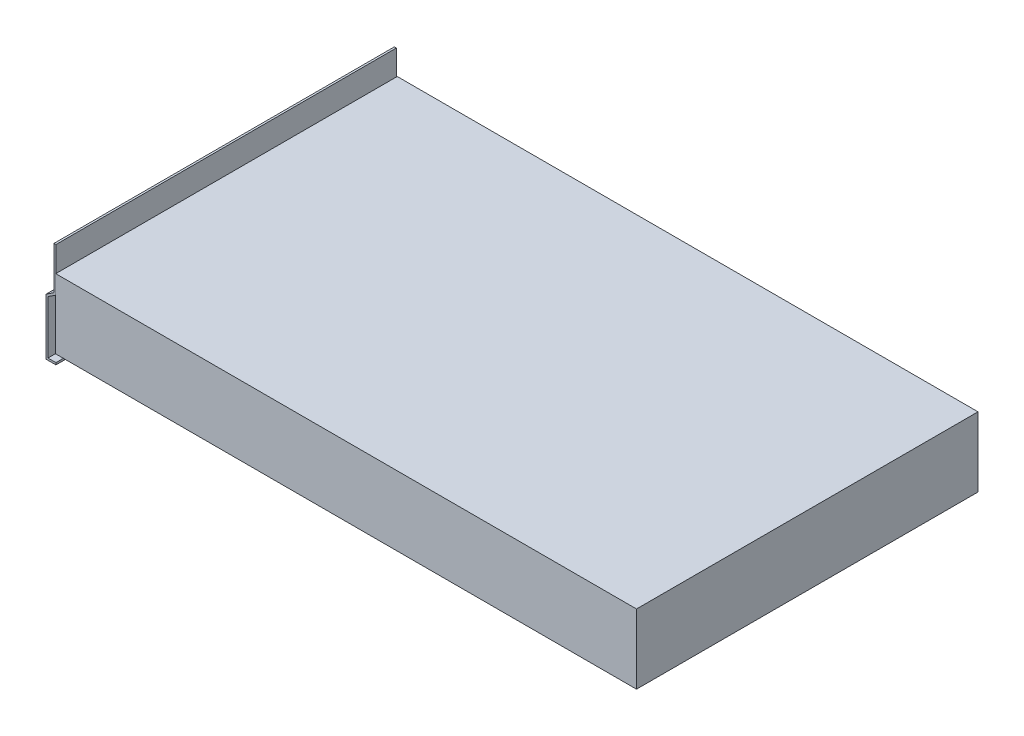
ISO-10303-21;
HEADER;
FILE_DESCRIPTION(('STEP AP214'),'2;1');
FILE_NAME('part.step','',(''),(''),'','','');
FILE_SCHEMA(('AUTOMOTIVE_DESIGN { 1 0 10303 214 1 1 1 1 }'));
ENDSEC;
DATA;
#1=APPLICATION_CONTEXT('core data for automotive mechanical design processes');
#2=APPLICATION_PROTOCOL_DEFINITION('international standard','automotive_design',2000,#1);
#3=PRODUCT_CONTEXT('',#1,'mechanical');
#4=PRODUCT('Part','Part','',(#3));
#5=PRODUCT_RELATED_PRODUCT_CATEGORY('part','',(#4));
#6=PRODUCT_DEFINITION_FORMATION('','',#4);
#7=PRODUCT_DEFINITION_CONTEXT('part definition',#1,'design');
#8=PRODUCT_DEFINITION('design','',#6,#7);
#9=PRODUCT_DEFINITION_SHAPE('','',#8);
#10=(LENGTH_UNIT() NAMED_UNIT(*) SI_UNIT(.MILLI.,.METRE.));
#11=(NAMED_UNIT(*) PLANE_ANGLE_UNIT() SI_UNIT($,.RADIAN.));
#12=(NAMED_UNIT(*) SI_UNIT($,.STERADIAN.) SOLID_ANGLE_UNIT());
#13=UNCERTAINTY_MEASURE_WITH_UNIT(LENGTH_MEASURE(1.E-05),#10,'distance_accuracy_value','');
#14=(GEOMETRIC_REPRESENTATION_CONTEXT(3) GLOBAL_UNCERTAINTY_ASSIGNED_CONTEXT((#13)) GLOBAL_UNIT_ASSIGNED_CONTEXT((#10,
#11,#12)) REPRESENTATION_CONTEXT('',''));
#15=CARTESIAN_POINT('',(0.,0.,0.));
#16=DIRECTION('',(0.,0.,1.));
#17=DIRECTION('',(1.,0.,0.));
#18=AXIS2_PLACEMENT_3D('',#15,#16,#17);
#19=CARTESIAN_POINT('',(0.,52.,171.5));
#20=DIRECTION('',(-1.,0.,0.));
#21=DIRECTION('',(0.,0.,1.));
#22=AXIS2_PLACEMENT_3D('',#19,#20,#21);
#23=PLANE('',#22);
#24=DIRECTION('',(0.,1.,0.));
#25=VECTOR('',#24,1.);
#26=CARTESIAN_POINT('',(0.,52.,-171.5));
#27=LINE('',#26,#25);
#28=CARTESIAN_POINT('',(0.,50.9283560127222,-171.5));
#29=VERTEX_POINT('',#28);
#30=CARTESIAN_POINT('',(0.,95.,-171.5));
#31=VERTEX_POINT('',#30);
#32=EDGE_CURVE('E151',#29,#31,#27,.T.);
#33=ORIENTED_EDGE('',*,*,#32,.T.);
#34=DIRECTION('',(0.,0.,-1.));
#35=VECTOR('',#34,1.);
#36=CARTESIAN_POINT('',(0.,95.,171.5));
#37=LINE('',#36,#35);
#38=CARTESIAN_POINT('',(0.,95.,171.5));
#39=VERTEX_POINT('',#38);
#40=EDGE_CURVE('E12',#39,#31,#37,.T.);
#41=ORIENTED_EDGE('',*,*,#40,.F.);
#42=DIRECTION('',(0.,1.,0.));
#43=VECTOR('',#42,1.);
#44=CARTESIAN_POINT('',(0.,52.,171.5));
#45=LINE('',#44,#43);
#46=CARTESIAN_POINT('',(0.,50.9283560127222,171.5));
#47=VERTEX_POINT('',#46);
#48=EDGE_CURVE('E106',#47,#39,#45,.T.);
#49=ORIENTED_EDGE('',*,*,#48,.F.);
#50=DIRECTION('',(0.,0.,-1.));
#51=VECTOR('',#50,1.);
#52=CARTESIAN_POINT('',(0.,50.9283560127222,171.5));
#53=LINE('',#52,#51);
#54=EDGE_CURVE('E147',#47,#29,#53,.T.);
#55=ORIENTED_EDGE('',*,*,#54,.T.);
#56=EDGE_LOOP('',(#33,#41,#49,#55));
#57=FACE_BOUND('',#56,.T.);
#58=ADVANCED_FACE('F44',(#57),#23,.F.);
#59=CARTESIAN_POINT('',(-2.,95.,171.5));
#60=DIRECTION('',(0.,1.,0.));
#61=DIRECTION('',(0.,0.,1.));
#62=AXIS2_PLACEMENT_3D('',#59,#60,#61);
#63=PLANE('',#62);
#64=DIRECTION('',(1.,0.,0.));
#65=VECTOR('',#64,1.);
#66=CARTESIAN_POINT('',(-2.,95.,-171.5));
#67=LINE('',#66,#65);
#68=CARTESIAN_POINT('',(-2.,95.,-171.5));
#69=VERTEX_POINT('',#68);
#70=EDGE_CURVE('E154',#69,#31,#67,.T.);
#71=ORIENTED_EDGE('',*,*,#70,.F.);
#72=DIRECTION('',(0.,0.,-1.));
#73=VECTOR('',#72,1.);
#74=CARTESIAN_POINT('',(-2.,95.,171.5));
#75=LINE('',#74,#73);
#76=CARTESIAN_POINT('',(-2.,95.,171.5));
#77=VERTEX_POINT('',#76);
#78=EDGE_CURVE('E52',#77,#69,#75,.T.);
#79=ORIENTED_EDGE('',*,*,#78,.F.);
#80=DIRECTION('',(1.,0.,0.));
#81=VECTOR('',#80,1.);
#82=CARTESIAN_POINT('',(-2.,95.,171.5));
#83=LINE('',#82,#81);
#84=EDGE_CURVE('E207',#77,#39,#83,.T.);
#85=ORIENTED_EDGE('',*,*,#84,.T.);
#86=ORIENTED_EDGE('',*,*,#40,.T.);
#87=EDGE_LOOP('',(#71,#79,#85,#86));
#88=FACE_BOUND('',#87,.T.);
#89=ADVANCED_FACE('F194',(#88),#63,.T.);
#90=CARTESIAN_POINT('',(-2.,52.,171.5));
#91=DIRECTION('',(-1.,0.,0.));
#92=DIRECTION('',(0.,0.,1.));
#93=AXIS2_PLACEMENT_3D('',#90,#91,#92);
#94=PLANE('',#93);
#95=DIRECTION('',(0.,1.,0.));
#96=VECTOR('',#95,1.);
#97=CARTESIAN_POINT('',(-2.,52.,-171.5));
#98=LINE('',#97,#96);
#99=CARTESIAN_POINT('',(-2.,52.,-171.5));
#100=VERTEX_POINT('',#99);
#101=EDGE_CURVE('E157',#100,#69,#98,.T.);
#102=ORIENTED_EDGE('',*,*,#101,.F.);
#103=DIRECTION('',(0.,0.,-1.));
#104=VECTOR('',#103,1.);
#105=CARTESIAN_POINT('',(-2.,52.,171.5));
#106=LINE('',#105,#104);
#107=CARTESIAN_POINT('',(-2.,52.,171.5));
#108=VERTEX_POINT('',#107);
#109=EDGE_CURVE('E184',#108,#100,#106,.T.);
#110=ORIENTED_EDGE('',*,*,#109,.F.);
#111=DIRECTION('',(0.,1.,0.));
#112=VECTOR('',#111,1.);
#113=CARTESIAN_POINT('',(-2.,52.,171.5));
#114=LINE('',#113,#112);
#115=EDGE_CURVE('E191',#108,#77,#114,.T.);
#116=ORIENTED_EDGE('',*,*,#115,.T.);
#117=ORIENTED_EDGE('',*,*,#78,.T.);
#118=EDGE_LOOP('',(#102,#110,#116,#117));
#119=FACE_BOUND('',#118,.T.);
#120=ADVANCED_FACE('F189',(#119),#94,.T.);
#121=CARTESIAN_POINT('',(-10.,46.6781222152427,171.5));
#122=DIRECTION('',(-0.553874528843114,0.832600147909438,0.));
#123=DIRECTION('',(-0.832600147909438,-0.553874528843114,0.));
#124=AXIS2_PLACEMENT_3D('',#121,#122,#123);
#125=PLANE('',#124);
#126=DIRECTION('',(0.832600147909438,0.553874528843114,0.));
#127=VECTOR('',#126,1.);
#128=CARTESIAN_POINT('',(-10.,46.6781222152427,-171.5));
#129=LINE('',#128,#127);
#130=CARTESIAN_POINT('',(-10.,46.6781222152427,-171.5));
#131=VERTEX_POINT('',#130);
#132=EDGE_CURVE('E160',#131,#100,#129,.T.);
#133=ORIENTED_EDGE('',*,*,#132,.F.);
#134=DIRECTION('',(0.,0.,-1.));
#135=VECTOR('',#134,1.);
#136=CARTESIAN_POINT('',(-10.,46.6781222152427,171.5));
#137=LINE('',#136,#135);
#138=CARTESIAN_POINT('',(-10.,46.6781222152427,171.5));
#139=VERTEX_POINT('',#138);
#140=EDGE_CURVE('E182',#139,#131,#137,.T.);
#141=ORIENTED_EDGE('',*,*,#140,.F.);
#142=DIRECTION('',(0.832600147909438,0.553874528843114,0.));
#143=VECTOR('',#142,1.);
#144=CARTESIAN_POINT('',(-10.,46.6781222152427,171.5));
#145=LINE('',#144,#143);
#146=EDGE_CURVE('E204',#139,#108,#145,.T.);
#147=ORIENTED_EDGE('',*,*,#146,.T.);
#148=ORIENTED_EDGE('',*,*,#109,.T.);
#149=EDGE_LOOP('',(#133,#141,#147,#148));
#150=FACE_BOUND('',#149,.T.);
#151=ADVANCED_FACE('F201',(#150),#125,.T.);
#152=CARTESIAN_POINT('',(-10.,-10.,171.5));
#153=DIRECTION('',(-1.,0.,0.));
#154=DIRECTION('',(0.,0.,1.));
#155=AXIS2_PLACEMENT_3D('',#152,#153,#154);
#156=PLANE('',#155);
#157=DIRECTION('',(0.,1.,0.));
#158=VECTOR('',#157,1.);
#159=CARTESIAN_POINT('',(-10.,-10.,-171.5));
#160=LINE('',#159,#158);
#161=CARTESIAN_POINT('',(-10.,-10.,-171.5));
#162=VERTEX_POINT('',#161);
#163=EDGE_CURVE('E163',#162,#131,#160,.T.);
#164=ORIENTED_EDGE('',*,*,#163,.F.);
#165=DIRECTION('',(0.,0.,-1.));
#166=VECTOR('',#165,1.);
#167=CARTESIAN_POINT('',(-10.,-10.,171.5));
#168=LINE('',#167,#166);
#169=CARTESIAN_POINT('',(-10.,-10.,171.5));
#170=VERTEX_POINT('',#169);
#171=EDGE_CURVE('E180',#170,#162,#168,.T.);
#172=ORIENTED_EDGE('',*,*,#171,.F.);
#173=DIRECTION('',(0.,1.,0.));
#174=VECTOR('',#173,1.);
#175=CARTESIAN_POINT('',(-10.,-10.,171.5));
#176=LINE('',#175,#174);
#177=EDGE_CURVE('E209',#170,#139,#176,.T.);
#178=ORIENTED_EDGE('',*,*,#177,.T.);
#179=ORIENTED_EDGE('',*,*,#140,.T.);
#180=EDGE_LOOP('',(#164,#172,#178,#179));
#181=FACE_BOUND('',#180,.T.);
#182=ADVANCED_FACE('F243',(#181),#156,.T.);
#183=CARTESIAN_POINT('',(0.,-10.,171.5));
#184=DIRECTION('',(0.,-1.,0.));
#185=DIRECTION('',(0.,0.,-1.));
#186=AXIS2_PLACEMENT_3D('',#183,#184,#185);
#187=PLANE('',#186);
#188=DIRECTION('',(-1.,0.,0.));
#189=VECTOR('',#188,1.);
#190=CARTESIAN_POINT('',(0.,-10.,-171.5));
#191=LINE('',#190,#189);
#192=CARTESIAN_POINT('',(0.,-10.,-171.5));
#193=VERTEX_POINT('',#192);
#194=EDGE_CURVE('E166',#193,#162,#191,.T.);
#195=ORIENTED_EDGE('',*,*,#194,.F.);
#196=DIRECTION('',(0.,0.,-1.));
#197=VECTOR('',#196,1.);
#198=CARTESIAN_POINT('',(0.,-10.,171.5));
#199=LINE('',#198,#197);
#200=CARTESIAN_POINT('',(0.,-10.,171.5));
#201=VERTEX_POINT('',#200);
#202=EDGE_CURVE('E178',#201,#193,#199,.T.);
#203=ORIENTED_EDGE('',*,*,#202,.F.);
#204=DIRECTION('',(-1.,0.,0.));
#205=VECTOR('',#204,1.);
#206=CARTESIAN_POINT('',(0.,-10.,171.5));
#207=LINE('',#206,#205);
#208=EDGE_CURVE('E215',#201,#170,#207,.T.);
#209=ORIENTED_EDGE('',*,*,#208,.T.);
#210=ORIENTED_EDGE('',*,*,#171,.T.);
#211=EDGE_LOOP('',(#195,#203,#209,#210));
#212=FACE_BOUND('',#211,.T.);
#213=ADVANCED_FACE('F246',(#212),#187,.T.);
#214=CARTESIAN_POINT('',(0.,-8.,171.5));
#215=DIRECTION('',(1.,0.,0.));
#216=DIRECTION('',(0.,0.,-1.));
#217=AXIS2_PLACEMENT_3D('',#214,#215,#216);
#218=PLANE('',#217);
#219=DIRECTION('',(0.,-1.,0.));
#220=VECTOR('',#219,1.);
#221=CARTESIAN_POINT('',(0.,-8.,-171.5));
#222=LINE('',#221,#220);
#223=CARTESIAN_POINT('',(0.,-8.,-171.5));
#224=VERTEX_POINT('',#223);
#225=EDGE_CURVE('E169',#224,#193,#222,.T.);
#226=ORIENTED_EDGE('',*,*,#225,.F.);
#227=DIRECTION('',(0.,0.,-1.));
#228=VECTOR('',#227,1.);
#229=CARTESIAN_POINT('',(0.,-8.,171.5));
#230=LINE('',#229,#228);
#231=CARTESIAN_POINT('',(0.,-8.,171.5));
#232=VERTEX_POINT('',#231);
#233=EDGE_CURVE('E142',#232,#224,#230,.T.);
#234=ORIENTED_EDGE('',*,*,#233,.F.);
#235=DIRECTION('',(0.,-1.,0.));
#236=VECTOR('',#235,1.);
#237=CARTESIAN_POINT('',(0.,-8.,171.5));
#238=LINE('',#237,#236);
#239=EDGE_CURVE('E135',#232,#201,#238,.T.);
#240=ORIENTED_EDGE('',*,*,#239,.T.);
#241=ORIENTED_EDGE('',*,*,#202,.T.);
#242=EDGE_LOOP('',(#226,#234,#240,#241));
#243=FACE_BOUND('',#242,.T.);
#244=ADVANCED_FACE('F219',(#243),#218,.T.);
#245=CARTESIAN_POINT('',(0.,-8.,171.5));
#246=DIRECTION('',(0.,-1.,0.));
#247=DIRECTION('',(0.,0.,-1.));
#248=AXIS2_PLACEMENT_3D('',#245,#246,#247);
#249=PLANE('',#248);
#250=DIRECTION('',(1.,0.,0.));
#251=VECTOR('',#250,1.);
#252=CARTESIAN_POINT('',(0.,-8.,-171.5));
#253=LINE('',#252,#251);
#254=CARTESIAN_POINT('',(-8.,-8.,-171.5));
#255=VERTEX_POINT('',#254);
#256=EDGE_CURVE('E141',#224,#255,#253,.F.);
#257=ORIENTED_EDGE('',*,*,#256,.T.);
#258=DIRECTION('',(0.,0.,-1.));
#259=VECTOR('',#258,1.);
#260=CARTESIAN_POINT('',(-8.,-8.,171.5));
#261=LINE('',#260,#259);
#262=CARTESIAN_POINT('',(-8.,-8.,171.5));
#263=VERTEX_POINT('',#262);
#264=EDGE_CURVE('E138',#263,#255,#261,.T.);
#265=ORIENTED_EDGE('',*,*,#264,.F.);
#266=DIRECTION('',(1.,0.,0.));
#267=VECTOR('',#266,1.);
#268=CARTESIAN_POINT('',(0.,-8.,171.5));
#269=LINE('',#268,#267);
#270=EDGE_CURVE('E128',#232,#263,#269,.F.);
#271=ORIENTED_EDGE('',*,*,#270,.F.);
#272=ORIENTED_EDGE('',*,*,#233,.T.);
#273=EDGE_LOOP('',(#257,#265,#271,#272));
#274=FACE_BOUND('',#273,.T.);
#275=ADVANCED_FACE('F139',(#274),#249,.F.);
#276=CARTESIAN_POINT('',(-8.,-10.,171.5));
#277=DIRECTION('',(-1.,0.,0.));
#278=DIRECTION('',(0.,0.,1.));
#279=AXIS2_PLACEMENT_3D('',#276,#277,#278);
#280=PLANE('',#279);
#281=DIRECTION('',(0.,1.,0.));
#282=VECTOR('',#281,1.);
#283=CARTESIAN_POINT('',(-8.,-10.,-171.5));
#284=LINE('',#283,#282);
#285=CARTESIAN_POINT('',(-8.,45.6064782279648,-171.5));
#286=VERTEX_POINT('',#285);
#287=EDGE_CURVE('E94',#255,#286,#284,.T.);
#288=ORIENTED_EDGE('',*,*,#287,.T.);
#289=DIRECTION('',(0.,0.,-1.));
#290=VECTOR('',#289,1.);
#291=CARTESIAN_POINT('',(-8.,45.6064782279648,171.5));
#292=LINE('',#291,#290);
#293=CARTESIAN_POINT('',(-8.,45.6064782279648,171.5));
#294=VERTEX_POINT('',#293);
#295=EDGE_CURVE('E143',#294,#286,#292,.T.);
#296=ORIENTED_EDGE('',*,*,#295,.F.);
#297=DIRECTION('',(0.,1.,0.));
#298=VECTOR('',#297,1.);
#299=CARTESIAN_POINT('',(-8.,-10.,171.5));
#300=LINE('',#299,#298);
#301=EDGE_CURVE('E132',#263,#294,#300,.T.);
#302=ORIENTED_EDGE('',*,*,#301,.F.);
#303=ORIENTED_EDGE('',*,*,#264,.T.);
#304=EDGE_LOOP('',(#288,#296,#302,#303));
#305=FACE_BOUND('',#304,.T.);
#306=ADVANCED_FACE('F145',(#305),#280,.F.);
#307=CARTESIAN_POINT('',(-8.89225094231377,45.0129219194238,171.5));
#308=DIRECTION('',(-0.553874528843114,0.832600147909438,0.));
#309=DIRECTION('',(-0.832600147909438,-0.553874528843114,0.));
#310=AXIS2_PLACEMENT_3D('',#307,#308,#309);
#311=PLANE('',#310);
#312=DIRECTION('',(0.832600147909438,0.553874528843114,0.));
#313=VECTOR('',#312,1.);
#314=CARTESIAN_POINT('',(-8.89225094231377,45.0129219194238,-171.5));
#315=LINE('',#314,#313);
#316=EDGE_CURVE('E100',#286,#29,#315,.T.);
#317=ORIENTED_EDGE('',*,*,#316,.T.);
#318=ORIENTED_EDGE('',*,*,#54,.F.);
#319=DIRECTION('',(0.832600147909438,0.553874528843114,0.));
#320=VECTOR('',#319,1.);
#321=CARTESIAN_POINT('',(-8.89225094231377,45.0129219194238,171.5));
#322=LINE('',#321,#320);
#323=EDGE_CURVE('E60',#294,#47,#322,.T.);
#324=ORIENTED_EDGE('',*,*,#323,.F.);
#325=ORIENTED_EDGE('',*,*,#295,.T.);
#326=EDGE_LOOP('',(#317,#318,#324,#325));
#327=FACE_BOUND('',#326,.T.);
#328=ADVANCED_FACE('F222',(#327),#311,.F.);
#329=CARTESIAN_POINT('',(0.,0.,171.5));
#330=DIRECTION('',(0.,0.,-1.));
#331=DIRECTION('',(-1.,0.,0.));
#332=AXIS2_PLACEMENT_3D('',#329,#330,#331);
#333=PLANE('',#332);
#334=ORIENTED_EDGE('',*,*,#48,.T.);
#335=ORIENTED_EDGE('',*,*,#84,.F.);
#336=ORIENTED_EDGE('',*,*,#115,.F.);
#337=ORIENTED_EDGE('',*,*,#146,.F.);
#338=ORIENTED_EDGE('',*,*,#177,.F.);
#339=ORIENTED_EDGE('',*,*,#208,.F.);
#340=ORIENTED_EDGE('',*,*,#239,.F.);
#341=ORIENTED_EDGE('',*,*,#270,.T.);
#342=ORIENTED_EDGE('',*,*,#301,.T.);
#343=ORIENTED_EDGE('',*,*,#323,.T.);
#344=EDGE_LOOP('',(#334,#335,#336,#337,#338,#339,#340,#341,#342,#343));
#345=FACE_BOUND('',#344,.T.);
#346=ADVANCED_FACE('F130',(#345),#333,.F.);
#347=CARTESIAN_POINT('',(0.,0.,-171.5));
#348=DIRECTION('',(0.,0.,-1.));
#349=DIRECTION('',(-1.,0.,0.));
#350=AXIS2_PLACEMENT_3D('',#347,#348,#349);
#351=PLANE('',#350);
#352=ORIENTED_EDGE('',*,*,#32,.F.);
#353=ORIENTED_EDGE('',*,*,#316,.F.);
#354=ORIENTED_EDGE('',*,*,#287,.F.);
#355=ORIENTED_EDGE('',*,*,#256,.F.);
#356=ORIENTED_EDGE('',*,*,#225,.T.);
#357=ORIENTED_EDGE('',*,*,#194,.T.);
#358=ORIENTED_EDGE('',*,*,#163,.T.);
#359=ORIENTED_EDGE('',*,*,#132,.T.);
#360=ORIENTED_EDGE('',*,*,#101,.T.);
#361=ORIENTED_EDGE('',*,*,#70,.T.);
#362=EDGE_LOOP('',(#352,#353,#354,#355,#356,#357,#358,#359,#360,#361));
#363=FACE_BOUND('',#362,.T.);
#364=ADVANCED_FACE('F197',(#363),#351,.T.);
#365=CLOSED_SHELL('',(#58,#89,#120,#151,#182,#213,#244,#275,#306,#328,#346,#364));
#366=MANIFOLD_SOLID_BREP('B2',#365);
#367=CARTESIAN_POINT('',(0.310787999523887,70.,172.));
#368=DIRECTION('',(1.,0.,0.));
#369=DIRECTION('',(0.,0.,-1.));
#370=AXIS2_PLACEMENT_3D('',#367,#368,#369);
#371=PLANE('',#370);
#372=DIRECTION('',(0.,0.,1.));
#373=VECTOR('',#372,1.);
#374=CARTESIAN_POINT('',(0.310787999523887,0.,172.));
#375=LINE('',#374,#373);
#376=CARTESIAN_POINT('',(0.310787999523887,0.,-172.));
#377=VERTEX_POINT('',#376);
#378=CARTESIAN_POINT('',(0.310787999523887,0.,172.));
#379=VERTEX_POINT('',#378);
#380=EDGE_CURVE('E422',#377,#379,#375,.T.);
#381=ORIENTED_EDGE('',*,*,#380,.T.);
#382=DIRECTION('',(0.,-1.,0.));
#383=VECTOR('',#382,1.);
#384=CARTESIAN_POINT('',(0.310787999523887,70.,172.));
#385=LINE('',#384,#383);
#386=CARTESIAN_POINT('',(0.310787999523887,70.,172.));
#387=VERTEX_POINT('',#386);
#388=EDGE_CURVE('E42',#387,#379,#385,.T.);
#389=ORIENTED_EDGE('',*,*,#388,.F.);
#390=DIRECTION('',(0.,0.,1.));
#391=VECTOR('',#390,1.);
#392=CARTESIAN_POINT('',(0.310787999523887,70.,172.));
#393=LINE('',#392,#391);
#394=CARTESIAN_POINT('',(0.310787999523887,70.,-172.));
#395=VERTEX_POINT('',#394);
#396=EDGE_CURVE('E432',#395,#387,#393,.T.);
#397=ORIENTED_EDGE('',*,*,#396,.F.);
#398=DIRECTION('',(0.,-1.,0.));
#399=VECTOR('',#398,1.);
#400=CARTESIAN_POINT('',(0.310787999523887,70.,-172.));
#401=LINE('',#400,#399);
#402=EDGE_CURVE('E437',#395,#377,#401,.T.);
#403=ORIENTED_EDGE('',*,*,#402,.T.);
#404=EDGE_LOOP('',(#381,#389,#397,#403));
#405=FACE_BOUND('',#404,.T.);
#406=ADVANCED_FACE('F324',(#405),#371,.F.);
#407=CARTESIAN_POINT('',(0.310787999523887,70.,172.));
#408=DIRECTION('',(0.,0.,-1.));
#409=DIRECTION('',(-1.,0.,0.));
#410=AXIS2_PLACEMENT_3D('',#407,#408,#409);
#411=PLANE('',#410);
#412=DIRECTION('',(1.,0.,0.));
#413=VECTOR('',#412,1.);
#414=CARTESIAN_POINT('',(0.310787999523887,0.,172.));
#415=LINE('',#414,#413);
#416=CARTESIAN_POINT('',(585.310787999524,0.,172.));
#417=VERTEX_POINT('',#416);
#418=EDGE_CURVE('E426',#379,#417,#415,.T.);
#419=ORIENTED_EDGE('',*,*,#418,.T.);
#420=DIRECTION('',(0.,-1.,0.));
#421=VECTOR('',#420,1.);
#422=CARTESIAN_POINT('',(585.310787999524,70.,172.));
#423=LINE('',#422,#421);
#424=CARTESIAN_POINT('',(585.310787999524,70.,172.));
#425=VERTEX_POINT('',#424);
#426=EDGE_CURVE('E332',#425,#417,#423,.T.);
#427=ORIENTED_EDGE('',*,*,#426,.F.);
#428=DIRECTION('',(1.,0.,0.));
#429=VECTOR('',#428,1.);
#430=CARTESIAN_POINT('',(0.310787999523887,70.,172.));
#431=LINE('',#430,#429);
#432=EDGE_CURVE('E371',#387,#425,#431,.T.);
#433=ORIENTED_EDGE('',*,*,#432,.F.);
#434=ORIENTED_EDGE('',*,*,#388,.T.);
#435=EDGE_LOOP('',(#419,#427,#433,#434));
#436=FACE_BOUND('',#435,.T.);
#437=ADVANCED_FACE('F461',(#436),#411,.F.);
#438=CARTESIAN_POINT('',(585.310787999524,70.,172.));
#439=DIRECTION('',(-1.,0.,0.));
#440=DIRECTION('',(0.,0.,1.));
#441=AXIS2_PLACEMENT_3D('',#438,#439,#440);
#442=PLANE('',#441);
#443=DIRECTION('',(0.,0.,-1.));
#444=VECTOR('',#443,1.);
#445=CARTESIAN_POINT('',(585.310787999524,0.,172.));
#446=LINE('',#445,#444);
#447=CARTESIAN_POINT('',(585.310787999524,0.,-172.));
#448=VERTEX_POINT('',#447);
#449=EDGE_CURVE('E358',#417,#448,#446,.T.);
#450=ORIENTED_EDGE('',*,*,#449,.T.);
#451=DIRECTION('',(0.,-1.,0.));
#452=VECTOR('',#451,1.);
#453=CARTESIAN_POINT('',(585.310787999524,70.,-172.));
#454=LINE('',#453,#452);
#455=CARTESIAN_POINT('',(585.310787999524,70.,-172.));
#456=VERTEX_POINT('',#455);
#457=EDGE_CURVE('E443',#456,#448,#454,.T.);
#458=ORIENTED_EDGE('',*,*,#457,.F.);
#459=DIRECTION('',(0.,0.,-1.));
#460=VECTOR('',#459,1.);
#461=CARTESIAN_POINT('',(585.310787999524,70.,172.));
#462=LINE('',#461,#460);
#463=EDGE_CURVE('E435',#425,#456,#462,.T.);
#464=ORIENTED_EDGE('',*,*,#463,.F.);
#465=ORIENTED_EDGE('',*,*,#426,.T.);
#466=EDGE_LOOP('',(#450,#458,#464,#465));
#467=FACE_BOUND('',#466,.T.);
#468=ADVANCED_FACE('F445',(#467),#442,.F.);
#469=CARTESIAN_POINT('',(0.310787999523887,70.,-172.));
#470=DIRECTION('',(0.,0.,1.));
#471=DIRECTION('',(1.,0.,0.));
#472=AXIS2_PLACEMENT_3D('',#469,#470,#471);
#473=PLANE('',#472);
#474=DIRECTION('',(-1.,0.,0.));
#475=VECTOR('',#474,1.);
#476=CARTESIAN_POINT('',(0.310787999523887,0.,-172.));
#477=LINE('',#476,#475);
#478=EDGE_CURVE('E364',#448,#377,#477,.T.);
#479=ORIENTED_EDGE('',*,*,#478,.T.);
#480=ORIENTED_EDGE('',*,*,#402,.F.);
#481=DIRECTION('',(-1.,0.,0.));
#482=VECTOR('',#481,1.);
#483=CARTESIAN_POINT('',(0.310787999523887,70.,-172.));
#484=LINE('',#483,#482);
#485=EDGE_CURVE('E340',#456,#395,#484,.T.);
#486=ORIENTED_EDGE('',*,*,#485,.F.);
#487=ORIENTED_EDGE('',*,*,#457,.T.);
#488=EDGE_LOOP('',(#479,#480,#486,#487));
#489=FACE_BOUND('',#488,.T.);
#490=ADVANCED_FACE('F452',(#489),#473,.F.);
#491=CARTESIAN_POINT('',(0.,70.,0.));
#492=DIRECTION('',(0.,1.,0.));
#493=DIRECTION('',(0.,0.,1.));
#494=AXIS2_PLACEMENT_3D('',#491,#492,#493);
#495=PLANE('',#494);
#496=ORIENTED_EDGE('',*,*,#396,.T.);
#497=ORIENTED_EDGE('',*,*,#432,.T.);
#498=ORIENTED_EDGE('',*,*,#463,.T.);
#499=ORIENTED_EDGE('',*,*,#485,.T.);
#500=EDGE_LOOP('',(#496,#497,#498,#499));
#501=FACE_BOUND('',#500,.T.);
#502=ADVANCED_FACE('F454',(#501),#495,.T.);
#503=CARTESIAN_POINT('',(0.,0.,0.));
#504=DIRECTION('',(0.,1.,0.));
#505=DIRECTION('',(0.,0.,1.));
#506=AXIS2_PLACEMENT_3D('',#503,#504,#505);
#507=PLANE('',#506);
#508=ORIENTED_EDGE('',*,*,#380,.F.);
#509=ORIENTED_EDGE('',*,*,#478,.F.);
#510=ORIENTED_EDGE('',*,*,#449,.F.);
#511=ORIENTED_EDGE('',*,*,#418,.F.);
#512=EDGE_LOOP('',(#508,#509,#510,#511));
#513=FACE_BOUND('',#512,.T.);
#514=ADVANCED_FACE('F448',(#513),#507,.F.);
#515=CLOSED_SHELL('',(#406,#437,#468,#490,#502,#514));
#516=CARTESIAN_POINT('',(1.81078799952389,68.5,0.));
#517=DIRECTION('',(1.,0.,0.));
#518=DIRECTION('',(0.,0.,-1.));
#519=AXIS2_PLACEMENT_3D('',#516,#517,#518);
#520=PLANE('',#519);
#521=DIRECTION('',(0.,0.,1.));
#522=VECTOR('',#521,1.);
#523=CARTESIAN_POINT('',(1.81078799952389,1.5,0.));
#524=LINE('',#523,#522);
#525=CARTESIAN_POINT('',(1.81078799952389,1.5,-170.5));
#526=VERTEX_POINT('',#525);
#527=CARTESIAN_POINT('',(1.81078799952389,1.5,170.5));
#528=VERTEX_POINT('',#527);
#529=EDGE_CURVE('E551',#526,#528,#524,.T.);
#530=ORIENTED_EDGE('',*,*,#529,.F.);
#531=DIRECTION('',(0.,-1.,0.));
#532=VECTOR('',#531,1.);
#533=CARTESIAN_POINT('',(1.81078799952389,68.5,-170.5));
#534=LINE('',#533,#532);
#535=CARTESIAN_POINT('',(1.81078799952389,68.5,-170.5));
#536=VERTEX_POINT('',#535);
#537=EDGE_CURVE('E417',#536,#526,#534,.T.);
#538=ORIENTED_EDGE('',*,*,#537,.F.);
#539=DIRECTION('',(0.,0.,1.));
#540=VECTOR('',#539,1.);
#541=CARTESIAN_POINT('',(1.81078799952389,68.5,0.));
#542=LINE('',#541,#540);
#543=CARTESIAN_POINT('',(1.81078799952389,68.5,170.5));
#544=VERTEX_POINT('',#543);
#545=EDGE_CURVE('E402',#536,#544,#542,.T.);
#546=ORIENTED_EDGE('',*,*,#545,.T.);
#547=DIRECTION('',(0.,-1.,0.));
#548=VECTOR('',#547,1.);
#549=CARTESIAN_POINT('',(1.81078799952389,68.5,170.5));
#550=LINE('',#549,#548);
#551=EDGE_CURVE('E414',#544,#528,#550,.T.);
#552=ORIENTED_EDGE('',*,*,#551,.T.);
#553=EDGE_LOOP('',(#530,#538,#546,#552));
#554=FACE_BOUND('',#553,.T.);
#555=ADVANCED_FACE('F413',(#554),#520,.T.);
#556=CARTESIAN_POINT('',(0.,68.5,170.5));
#557=DIRECTION('',(0.,0.,-1.));
#558=DIRECTION('',(-1.,0.,0.));
#559=AXIS2_PLACEMENT_3D('',#556,#557,#558);
#560=PLANE('',#559);
#561=DIRECTION('',(1.,0.,0.));
#562=VECTOR('',#561,1.);
#563=CARTESIAN_POINT('',(0.,1.5,170.5));
#564=LINE('',#563,#562);
#565=CARTESIAN_POINT('',(583.810787999524,1.5,170.5));
#566=VERTEX_POINT('',#565);
#567=EDGE_CURVE('E421',#528,#566,#564,.T.);
#568=ORIENTED_EDGE('',*,*,#567,.F.);
#569=ORIENTED_EDGE('',*,*,#551,.F.);
#570=DIRECTION('',(1.,0.,0.));
#571=VECTOR('',#570,1.);
#572=CARTESIAN_POINT('',(0.,68.5,170.5));
#573=LINE('',#572,#571);
#574=CARTESIAN_POINT('',(583.810787999524,68.5,170.5));
#575=VERTEX_POINT('',#574);
#576=EDGE_CURVE('E398',#544,#575,#573,.T.);
#577=ORIENTED_EDGE('',*,*,#576,.T.);
#578=DIRECTION('',(0.,-1.,0.));
#579=VECTOR('',#578,1.);
#580=CARTESIAN_POINT('',(583.810787999524,68.5,170.5));
#581=LINE('',#580,#579);
#582=EDGE_CURVE('E423',#575,#566,#581,.T.);
#583=ORIENTED_EDGE('',*,*,#582,.T.);
#584=EDGE_LOOP('',(#568,#569,#577,#583));
#585=FACE_BOUND('',#584,.T.);
#586=ADVANCED_FACE('F420',(#585),#560,.T.);
#587=CARTESIAN_POINT('',(583.810787999524,68.5,0.));
#588=DIRECTION('',(-1.,0.,0.));
#589=DIRECTION('',(0.,0.,1.));
#590=AXIS2_PLACEMENT_3D('',#587,#588,#589);
#591=PLANE('',#590);
#592=DIRECTION('',(0.,0.,-1.));
#593=VECTOR('',#592,1.);
#594=CARTESIAN_POINT('',(583.810787999524,1.5,0.));
#595=LINE('',#594,#593);
#596=CARTESIAN_POINT('',(583.810787999524,1.5,-170.5));
#597=VERTEX_POINT('',#596);
#598=EDGE_CURVE('E554',#566,#597,#595,.T.);
#599=ORIENTED_EDGE('',*,*,#598,.F.);
#600=ORIENTED_EDGE('',*,*,#582,.F.);
#601=DIRECTION('',(0.,0.,-1.));
#602=VECTOR('',#601,1.);
#603=CARTESIAN_POINT('',(583.810787999524,68.5,0.));
#604=LINE('',#603,#602);
#605=CARTESIAN_POINT('',(583.810787999524,68.5,-170.5));
#606=VERTEX_POINT('',#605);
#607=EDGE_CURVE('E403',#575,#606,#604,.T.);
#608=ORIENTED_EDGE('',*,*,#607,.T.);
#609=DIRECTION('',(0.,-1.,0.));
#610=VECTOR('',#609,1.);
#611=CARTESIAN_POINT('',(583.810787999524,68.5,-170.5));
#612=LINE('',#611,#610);
#613=EDGE_CURVE('E428',#606,#597,#612,.T.);
#614=ORIENTED_EDGE('',*,*,#613,.T.);
#615=EDGE_LOOP('',(#599,#600,#608,#614));
#616=FACE_BOUND('',#615,.T.);
#617=ADVANCED_FACE('F509',(#616),#591,.T.);
#618=CARTESIAN_POINT('',(0.,68.5,-170.5));
#619=DIRECTION('',(0.,0.,1.));
#620=DIRECTION('',(1.,0.,0.));
#621=AXIS2_PLACEMENT_3D('',#618,#619,#620);
#622=PLANE('',#621);
#623=DIRECTION('',(-1.,0.,0.));
#624=VECTOR('',#623,1.);
#625=CARTESIAN_POINT('',(0.,1.5,-170.5));
#626=LINE('',#625,#624);
#627=EDGE_CURVE('E418',#597,#526,#626,.T.);
#628=ORIENTED_EDGE('',*,*,#627,.F.);
#629=ORIENTED_EDGE('',*,*,#613,.F.);
#630=DIRECTION('',(-1.,0.,0.));
#631=VECTOR('',#630,1.);
#632=CARTESIAN_POINT('',(0.,68.5,-170.5));
#633=LINE('',#632,#631);
#634=EDGE_CURVE('E557',#606,#536,#633,.T.);
#635=ORIENTED_EDGE('',*,*,#634,.T.);
#636=ORIENTED_EDGE('',*,*,#537,.T.);
#637=EDGE_LOOP('',(#628,#629,#635,#636));
#638=FACE_BOUND('',#637,.T.);
#639=ADVANCED_FACE('F518',(#638),#622,.T.);
#640=CARTESIAN_POINT('',(0.,68.5,0.));
#641=DIRECTION('',(0.,1.,0.));
#642=DIRECTION('',(0.,0.,1.));
#643=AXIS2_PLACEMENT_3D('',#640,#641,#642);
#644=PLANE('',#643);
#645=ORIENTED_EDGE('',*,*,#545,.F.);
#646=ORIENTED_EDGE('',*,*,#634,.F.);
#647=ORIENTED_EDGE('',*,*,#607,.F.);
#648=ORIENTED_EDGE('',*,*,#576,.F.);
#649=EDGE_LOOP('',(#645,#646,#647,#648));
#650=FACE_BOUND('',#649,.T.);
#651=ADVANCED_FACE('F400',(#650),#644,.F.);
#652=CARTESIAN_POINT('',(0.,1.5,0.));
#653=DIRECTION('',(0.,1.,0.));
#654=DIRECTION('',(0.,0.,1.));
#655=AXIS2_PLACEMENT_3D('',#652,#653,#654);
#656=PLANE('',#655);
#657=ORIENTED_EDGE('',*,*,#529,.T.);
#658=ORIENTED_EDGE('',*,*,#567,.T.);
#659=ORIENTED_EDGE('',*,*,#598,.T.);
#660=ORIENTED_EDGE('',*,*,#627,.T.);
#661=EDGE_LOOP('',(#657,#658,#659,#660));
#662=FACE_BOUND('',#661,.T.);
#663=ADVANCED_FACE('F537',(#662),#656,.T.);
#664=CLOSED_SHELL('',(#555,#586,#617,#639,#651,#663));
#665=ORIENTED_CLOSED_SHELL('',*,#664,.T.);
#666=BREP_WITH_VOIDS('B6',#515,(#665));
#667=ADVANCED_BREP_SHAPE_REPRESENTATION('',(#18,#366,#666),#14);
#668=SHAPE_DEFINITION_REPRESENTATION(#9,#667);
ENDSEC;
END-ISO-10303-21;
